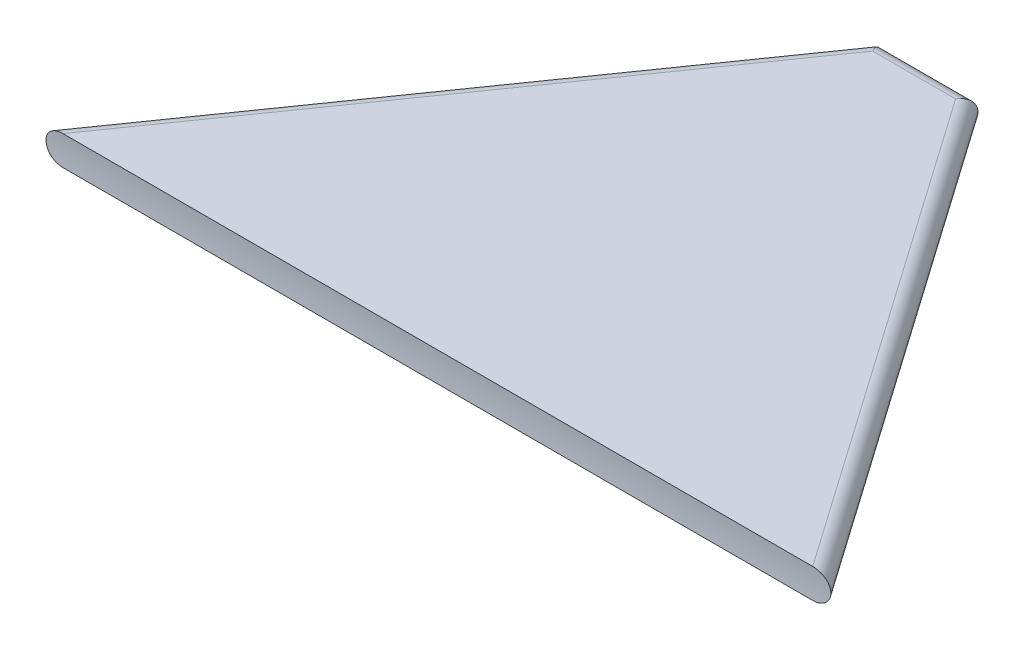
ISO-10303-21;
HEADER;
FILE_DESCRIPTION(('STEP AP214'),'2;1');
FILE_NAME('part.step','',(''),(''),'','','');
FILE_SCHEMA(('AUTOMOTIVE_DESIGN { 1 0 10303 214 1 1 1 1 }'));
ENDSEC;
DATA;
#1=APPLICATION_CONTEXT('core data for automotive mechanical design processes');
#2=APPLICATION_PROTOCOL_DEFINITION('international standard','automotive_design',2000,#1);
#3=PRODUCT_CONTEXT('',#1,'mechanical');
#4=PRODUCT('Part','Part','',(#3));
#5=PRODUCT_RELATED_PRODUCT_CATEGORY('part','',(#4));
#6=PRODUCT_DEFINITION_FORMATION('','',#4);
#7=PRODUCT_DEFINITION_CONTEXT('part definition',#1,'design');
#8=PRODUCT_DEFINITION('design','',#6,#7);
#9=PRODUCT_DEFINITION_SHAPE('','',#8);
#10=(LENGTH_UNIT() NAMED_UNIT(*) SI_UNIT(.MILLI.,.METRE.));
#11=(NAMED_UNIT(*) PLANE_ANGLE_UNIT() SI_UNIT($,.RADIAN.));
#12=(NAMED_UNIT(*) SI_UNIT($,.STERADIAN.) SOLID_ANGLE_UNIT());
#13=UNCERTAINTY_MEASURE_WITH_UNIT(LENGTH_MEASURE(1.E-05),#10,'distance_accuracy_value','');
#14=(GEOMETRIC_REPRESENTATION_CONTEXT(3) GLOBAL_UNCERTAINTY_ASSIGNED_CONTEXT((#13)) GLOBAL_UNIT_ASSIGNED_CONTEXT((#10,
#11,#12)) REPRESENTATION_CONTEXT('',''));
#15=CARTESIAN_POINT('',(0.,0.,0.));
#16=DIRECTION('',(0.,0.,1.));
#17=DIRECTION('',(1.,0.,0.));
#18=AXIS2_PLACEMENT_3D('',#15,#16,#17);
#19=CARTESIAN_POINT('',(0.,3.,0.));
#20=DIRECTION('',(0.,1.,0.));
#21=DIRECTION('',(0.,0.,1.));
#22=AXIS2_PLACEMENT_3D('',#19,#20,#21);
#23=PLANE('',#22);
#24=DIRECTION('',(1.,0.,0.));
#25=VECTOR('',#24,1.);
#26=CARTESIAN_POINT('',(-46.1054977438485,3.,0.));
#27=LINE('',#26,#25);
#28=CARTESIAN_POINT('',(-44.2745144014884,3.,0.));
#29=VERTEX_POINT('',#28);
#30=CARTESIAN_POINT('',(32.0635189137915,3.,0.));
#31=VERTEX_POINT('',#30);
#32=EDGE_CURVE('E106',#29,#31,#27,.T.);
#33=ORIENTED_EDGE('',*,*,#32,.T.);
#34=DIRECTION('',(-0.573462344363328,0.,-0.819231920519041));
#35=VECTOR('',#34,1.);
#36=CARTESIAN_POINT('',(-2.33434562462702,3.,-49.139806483455));
#37=LINE('',#36,#35);
#38=CARTESIAN_POINT('',(-1.8864810862085,3.,-48.5));
#39=VERTEX_POINT('',#38);
#40=EDGE_CURVE('E51',#31,#39,#37,.T.);
#41=ORIENTED_EDGE('',*,*,#40,.T.);
#42=DIRECTION('',(-1.,0.,0.));
#43=VECTOR('',#42,1.);
#44=CARTESIAN_POINT('',(-11.1054977438485,3.,-48.5));
#45=LINE('',#44,#43);
#46=CARTESIAN_POINT('',(-10.3245144014884,3.,-48.5));
#47=VERTEX_POINT('',#46);
#48=EDGE_CURVE('E59',#39,#47,#45,.T.);
#49=ORIENTED_EDGE('',*,*,#48,.T.);
#50=DIRECTION('',(-0.573462344363328,0.,0.819231920519041));
#51=VECTOR('',#50,1.);
#52=CARTESIAN_POINT('',(-44.8766498630699,3.,0.860193516544996));
#53=LINE('',#52,#51);
#54=EDGE_CURVE('E140',#47,#29,#53,.T.);
#55=ORIENTED_EDGE('',*,*,#54,.T.);
#56=EDGE_LOOP('',(#33,#41,#49,#55));
#57=FACE_BOUND('',#56,.T.);
#58=ADVANCED_FACE('F36',(#57),#23,.T.);
#59=CARTESIAN_POINT('',(0.,0.,0.));
#60=DIRECTION('',(0.,1.,0.));
#61=DIRECTION('',(0.,0.,1.));
#62=AXIS2_PLACEMENT_3D('',#59,#60,#61);
#63=PLANE('',#62);
#64=DIRECTION('',(-1.,0.,0.));
#65=VECTOR('',#64,1.);
#66=CARTESIAN_POINT('',(0.,0.,-48.5));
#67=LINE('',#66,#65);
#68=CARTESIAN_POINT('',(-10.3245144014884,0.,-48.5));
#69=VERTEX_POINT('',#68);
#70=CARTESIAN_POINT('',(-1.88648108620851,0.,-48.5));
#71=VERTEX_POINT('',#70);
#72=EDGE_CURVE('E95',#69,#71,#67,.F.);
#73=ORIENTED_EDGE('',*,*,#72,.T.);
#74=DIRECTION('',(-0.573462344363328,0.,-0.819231920519041));
#75=VECTOR('',#74,1.);
#76=CARTESIAN_POINT('',(21.5191402105983,0.,-15.0633981474188));
#77=LINE('',#76,#75);
#78=CARTESIAN_POINT('',(32.0635189137915,0.,0.));
#79=VERTEX_POINT('',#78);
#80=EDGE_CURVE('E99',#71,#79,#77,.F.);
#81=ORIENTED_EDGE('',*,*,#80,.T.);
#82=DIRECTION('',(1.,0.,0.));
#83=VECTOR('',#82,1.);
#84=CARTESIAN_POINT('',(-46.1054977438485,0.,0.));
#85=LINE('',#84,#83);
#86=CARTESIAN_POINT('',(-44.2745144014884,0.,0.));
#87=VERTEX_POINT('',#86);
#88=EDGE_CURVE('E133',#87,#79,#85,.T.);
#89=ORIENTED_EDGE('',*,*,#88,.F.);
#90=DIRECTION('',(-0.573462344363328,0.,0.819231920519041));
#91=VECTOR('',#90,1.);
#92=CARTESIAN_POINT('',(-29.7144391956298,0.,-20.8001074369409));
#93=LINE('',#92,#91);
#94=EDGE_CURVE('E101',#87,#69,#93,.F.);
#95=ORIENTED_EDGE('',*,*,#94,.T.);
#96=EDGE_LOOP('',(#73,#81,#89,#95));
#97=FACE_BOUND('',#96,.T.);
#98=ADVANCED_FACE('F97',(#97),#63,.F.);
#99=CARTESIAN_POINT('',(-29.7144391956298,1.5,-20.8001074369409));
#100=DIRECTION('',(0.573462344363328,0.,-0.819231920519041));
#101=DIRECTION('',(-0.819231920519041,0.,-0.573462344363328));
#102=AXIS2_PLACEMENT_3D('',#99,#100,#101);
#103=CYLINDRICAL_SURFACE('',#102,1.5);
#104=CARTESIAN_POINT('',(-44.2745144014884,3.,0.));
#105=CARTESIAN_POINT('',(-44.3382009659357,2.99998825338362,8.65655375250849E-07));
#106=CARTESIAN_POINT('',(-44.4018517896834,2.99727547465792,-0.000216086659095627));
#107=CARTESIAN_POINT('',(-44.5287392622743,2.98631693495949,-0.0010797299325599));
#108=CARTESIAN_POINT('',(-44.5919753902021,2.97806520790056,-0.0017268842614689));
#109=CARTESIAN_POINT('',(-44.7807241607876,2.94474552324019,-0.00430933200088901));
#110=CARTESIAN_POINT('',(-44.9048817217672,2.91111145630319,-0.00688554811933872));
#111=CARTESIAN_POINT('',(-45.1172950875952,2.83058413065742,-0.0126867071255565));
#112=CARTESIAN_POINT('',(-45.2073541838005,2.78836141190078,-0.0156362525641057));
#113=CARTESIAN_POINT('',(-45.3792401132866,2.68973540325946,-0.0220816512899539));
#114=CARTESIAN_POINT('',(-45.4610814015907,2.63335764607212,-0.0255765166842343));
#115=CARTESIAN_POINT('',(-45.6140234960528,2.50623599987034,-0.0327468065245787));
#116=CARTESIAN_POINT('',(-45.6850272705272,2.43537426595902,-0.0364235114656585));
#117=CARTESIAN_POINT('',(-45.8116518325417,2.2808727853339,-0.0434062243533402));
#118=CARTESIAN_POINT('',(-45.8672779568969,2.19723748737029,-0.0467123606683911));
#119=CARTESIAN_POINT('',(-45.9526558841045,2.03290944553521,-0.0519793934569253));
#120=CARTESIAN_POINT('',(-45.9849955548997,1.95356084907419,-0.0540660611672907));
#121=CARTESIAN_POINT('',(-46.0337470587451,1.7901972621449,-0.0572607631711594));
#122=CARTESIAN_POINT('',(-46.0502054007215,1.70619666388725,-0.0583716541921447));
#123=CARTESIAN_POINT('',(-46.0601533937113,1.60134450066582,-0.0590437961483084));
#124=CARTESIAN_POINT('',(-46.0615906901822,1.5810879078115,-0.0591409722281058));
#125=CARTESIAN_POINT('',(-46.0635050940414,1.54055733780779,-0.0592704728693632));
#126=CARTESIAN_POINT('',(-46.063983531689,1.52028342383502,-0.0593028872768238));
#127=CARTESIAN_POINT('',(-46.0639855912615,1.5,-0.0593030751241867));
#128=B_SPLINE_CURVE_WITH_KNOTS('',3,(#104,#105,#106,#107,#108,#109,#110,#111,#112,#113,#114,
#115,#116,#117,#118,#119,#120,#121,#122,#123,#124,#125,#126,#127),.UNSPECIFIED.,.F.,.F.,(4,2,2,
2,2,2,2,2,2,2,2,4),(0.,0.190924227704898,0.382054433520733,0.765485215312116,1.06285355222447,
1.35968930540345,1.6590438692783,1.95829441132203,2.21398010553392,2.46891472368585,
2.52982488664365,2.5906504880859),.UNSPECIFIED.);
#129=CARTESIAN_POINT('',(-46.0639855912615,1.5,-0.0593030751241917));
#130=VERTEX_POINT('',#129);
#131=EDGE_CURVE('E81',#29,#130,#128,.T.);
#132=ORIENTED_EDGE('',*,*,#131,.F.);
#133=ORIENTED_EDGE('',*,*,#54,.F.);
#134=CARTESIAN_POINT('',(-10.3245144014884,1.5,-48.5));
#135=DIRECTION('',(0.886978676283519,0.,-0.461810380804));
#136=DIRECTION('',(0.461810380804,0.,0.886978676283519));
#137=AXIS2_PLACEMENT_3D('',#134,#135,#136);
#138=ELLIPSE('',#137,1.69113422916216,1.5);
#139=CARTESIAN_POINT('',(-11.1054977438485,1.5,-50.));
#140=VERTEX_POINT('',#139);
#141=EDGE_CURVE('E131',#140,#47,#138,.T.);
#142=ORIENTED_EDGE('',*,*,#141,.F.);
#143=DIRECTION('',(-0.573462344363328,0.,0.819231920519041));
#144=VECTOR('',#143,1.);
#145=CARTESIAN_POINT('',(-11.1054977438484,1.5,-50.));
#146=LINE('',#145,#144);
#147=EDGE_CURVE('E130',#130,#140,#146,.F.);
#148=ORIENTED_EDGE('',*,*,#147,.F.);
#149=EDGE_LOOP('',(#132,#133,#142,#148));
#150=FACE_BOUND('',#149,.T.);
#151=ADVANCED_FACE('F38',(#150),#103,.T.);
#152=CARTESIAN_POINT('',(0.,1.5,-48.5));
#153=DIRECTION('',(1.,0.,0.));
#154=DIRECTION('',(0.,0.,-1.));
#155=AXIS2_PLACEMENT_3D('',#152,#153,#154);
#156=CYLINDRICAL_SURFACE('',#155,1.5);
#157=ORIENTED_EDGE('',*,*,#141,.T.);
#158=ORIENTED_EDGE('',*,*,#48,.F.);
#159=CARTESIAN_POINT('',(-1.88648108620851,1.5,-48.5));
#160=DIRECTION('',(0.886978676283519,0.,0.461810380804));
#161=DIRECTION('',(0.461810380804,0.,-0.886978676283519));
#162=AXIS2_PLACEMENT_3D('',#159,#160,#161);
#163=ELLIPSE('',#162,1.69113422916216,1.5);
#164=CARTESIAN_POINT('',(-1.10549774384845,1.5,-50.));
#165=VERTEX_POINT('',#164);
#166=EDGE_CURVE('E70',#165,#39,#163,.T.);
#167=ORIENTED_EDGE('',*,*,#166,.F.);
#168=DIRECTION('',(-1.,0.,0.));
#169=VECTOR('',#168,1.);
#170=CARTESIAN_POINT('',(-1.10549774384845,1.5,-50.));
#171=LINE('',#170,#169);
#172=EDGE_CURVE('E116',#140,#165,#171,.F.);
#173=ORIENTED_EDGE('',*,*,#172,.F.);
#174=EDGE_LOOP('',(#157,#158,#167,#173));
#175=FACE_BOUND('',#174,.T.);
#176=ADVANCED_FACE('F145',(#175),#156,.T.);
#177=CARTESIAN_POINT('',(-9.87664986306989,1.5,-49.139806483455));
#178=DIRECTION('',(-0.573462344363328,0.,0.819231920519041));
#179=DIRECTION('',(0.819231920519041,0.,0.573462344363328));
#180=AXIS2_PLACEMENT_3D('',#177,#178,#179);
#181=CYLINDRICAL_SURFACE('',#180,1.5);
#182=CARTESIAN_POINT('',(-46.0639855912615,1.5,-0.0593030751241917));
#183=CARTESIAN_POINT('',(-46.0639879953298,1.46228620755016,-0.059303784795781));
#184=CARTESIAN_POINT('',(-46.0623267576608,1.42459211727577,-0.0591906471654183));
#185=CARTESIAN_POINT('',(-46.0557177146137,1.34950633377035,-0.0587440299534168));
#186=CARTESIAN_POINT('',(-46.0507709569667,1.3121145479827,-0.0584106206151726));
#187=CARTESIAN_POINT('',(-46.0311290498095,1.20113053753896,-0.0570953962826096));
#188=CARTESIAN_POINT('',(-46.0116312990991,1.12833881214,-0.0557984314805437));
#189=CARTESIAN_POINT('',(-45.9607750568852,0.987182386452793,-0.0525128666221282));
#190=CARTESIAN_POINT('',(-45.9294260578199,0.918814194260485,-0.0505248202004345));
#191=CARTESIAN_POINT('',(-45.8562217784273,0.787931142704664,-0.0460682757769419));
#192=CARTESIAN_POINT('',(-45.8143577528452,0.725421215326651,-0.0435993782412805));
#193=CARTESIAN_POINT('',(-45.7194219335762,0.604509102331807,-0.0382900425053087));
#194=CARTESIAN_POINT('',(-45.6658966000408,0.546465361931217,-0.0354372385351372));
#195=CARTESIAN_POINT('',(-45.5509203512381,0.438916692775621,-0.0297275769841082));
#196=CARTESIAN_POINT('',(-45.4894687311598,0.389412524281435,-0.02687071906514));
#197=CARTESIAN_POINT('',(-45.3516655610329,0.293215239307214,-0.0210094286252724));
#198=CARTESIAN_POINT('',(-45.2744220981459,0.247800186324312,-0.0180369993848131));
#199=CARTESIAN_POINT('',(-45.1141278538293,0.168471180652314,-0.0126298478571136));
#200=CARTESIAN_POINT('',(-45.0310672939031,0.134577182974339,-0.0101960610414502));
#201=CARTESIAN_POINT('',(-44.8379474230306,0.0705116180244102,-0.00548875587833649));
#202=CARTESIAN_POINT('',(-44.7267074064321,0.0438817942124404,-0.00344034061722796));
#203=CARTESIAN_POINT('',(-44.5017370277022,0.00865156397465489,-0.000683390592443864));
#204=CARTESIAN_POINT('',(-44.3880159564987,-7.28084604039057E-06,2.94863634492936E-05));
#205=CARTESIAN_POINT('',(-44.2745144014884,0.,0.));
#206=B_SPLINE_CURVE_WITH_KNOTS('',3,(#182,#183,#184,#185,#186,#187,#188,#189,#190,#191,#192,
#193,#194,#195,#196,#197,#198,#199,#200,#201,#202,#203,#204,#205),.UNSPECIFIED.,.F.,.F.,(4,2,2,
2,2,2,2,2,2,2,2,4),(0.,0.113066273445151,0.226096508091479,0.451000512584329,0.675724757144774,
0.900636525362247,1.13672390893469,1.37283230005415,1.64076213181866,1.90915369379741,
2.25080932043475,2.59135219243471),.UNSPECIFIED.);
#207=EDGE_CURVE('E122',#130,#87,#206,.T.);
#208=ORIENTED_EDGE('',*,*,#207,.F.);
#209=ORIENTED_EDGE('',*,*,#147,.T.);
#210=CARTESIAN_POINT('',(-10.3245144014884,1.5,-48.5));
#211=DIRECTION('',(-0.886978676283519,0.,0.461810380804));
#212=DIRECTION('',(-0.461810380804,0.,-0.886978676283519));
#213=AXIS2_PLACEMENT_3D('',#210,#211,#212);
#214=ELLIPSE('',#213,1.69113422916216,1.5);
#215=EDGE_CURVE('E120',#69,#140,#214,.F.);
#216=ORIENTED_EDGE('',*,*,#215,.F.);
#217=ORIENTED_EDGE('',*,*,#94,.F.);
#218=EDGE_LOOP('',(#208,#209,#216,#217));
#219=FACE_BOUND('',#218,.T.);
#220=ADVANCED_FACE('F156',(#219),#181,.T.);
#221=CARTESIAN_POINT('',(21.5191402105983,1.5,-15.0633981474188));
#222=DIRECTION('',(0.573462344363328,0.,0.819231920519041));
#223=DIRECTION('',(0.81923192051904,0.,-0.573462344363328));
#224=AXIS2_PLACEMENT_3D('',#221,#222,#223);
#225=CYLINDRICAL_SURFACE('',#224,1.5);
#226=CARTESIAN_POINT('',(33.8529901035646,1.5,-0.0593030751241987));
#227=CARTESIAN_POINT('',(33.8529925076329,1.53771379244984,-0.0593037847957816));
#228=CARTESIAN_POINT('',(33.8513312699639,1.57540788272423,-0.0591906471654167));
#229=CARTESIAN_POINT('',(33.8447222269168,1.65049366622965,-0.0587440299534143));
#230=CARTESIAN_POINT('',(33.8397754692698,1.6878854520173,-0.0584106206151715));
#231=CARTESIAN_POINT('',(33.8201335621126,1.79886946246104,-0.0570953962826107));
#232=CARTESIAN_POINT('',(33.8006358114022,1.87166118785999,-0.0557984314805443));
#233=CARTESIAN_POINT('',(33.7497795691883,2.01281761354721,-0.0525128666221272));
#234=CARTESIAN_POINT('',(33.718430570123,2.08118580573952,-0.0505248202004325));
#235=CARTESIAN_POINT('',(33.6452262907304,2.21206885729534,-0.0460682757769383));
#236=CARTESIAN_POINT('',(33.6033622651483,2.27457878467335,-0.0435993782412765));
#237=CARTESIAN_POINT('',(33.5084264458793,2.3954908976682,-0.0382900425053047));
#238=CARTESIAN_POINT('',(33.4549011123439,2.45353463806879,-0.0354372385351336));
#239=CARTESIAN_POINT('',(33.3399248635412,2.56108330722438,-0.0297275769841034));
#240=CARTESIAN_POINT('',(33.2784732434628,2.61058747571857,-0.0268707190651335));
#241=CARTESIAN_POINT('',(33.140670073336,2.70678476069279,-0.0210094286252709));
#242=CARTESIAN_POINT('',(33.063426610449,2.75219981367569,-0.0180369993848193));
#243=CARTESIAN_POINT('',(32.9031323661324,2.83152881934768,-0.0126298478571201));
#244=CARTESIAN_POINT('',(32.8200718062062,2.86542281702566,-0.0101960610414494));
#245=CARTESIAN_POINT('',(32.6269519353337,2.92948838197559,-0.00548875587832813));
#246=CARTESIAN_POINT('',(32.5157119187352,2.95611820578756,-0.00344034061722223));
#247=CARTESIAN_POINT('',(32.2907415400052,2.99134843602535,-0.000683390592444676));
#248=CARTESIAN_POINT('',(32.1770204688018,3.00000728084604,2.94863634446109E-05));
#249=CARTESIAN_POINT('',(32.0635189137915,3.,0.));
#250=B_SPLINE_CURVE_WITH_KNOTS('',3,(#226,#227,#228,#229,#230,#231,#232,#233,#234,#235,#236,
#237,#238,#239,#240,#241,#242,#243,#244,#245,#246,#247,#248,#249),.UNSPECIFIED.,.F.,.F.,(4,2,2,
2,2,2,2,2,2,2,2,4),(0.,0.113066273445152,0.226096508091479,0.451000512584329,0.675724757144782,
0.900636525362245,1.13672390893469,1.37283230005416,1.64076213181867,1.90915369379741,
2.25080932043476,2.59135219243472),.UNSPECIFIED.);
#251=CARTESIAN_POINT('',(33.8529901035646,1.5,-0.0593030751241917));
#252=VERTEX_POINT('',#251);
#253=EDGE_CURVE('E149',#252,#31,#250,.T.);
#254=ORIENTED_EDGE('',*,*,#253,.F.);
#255=DIRECTION('',(-0.573462344363328,0.,-0.819231920519041));
#256=VECTOR('',#255,1.);
#257=CARTESIAN_POINT('',(33.8945022561516,1.5,0.));
#258=LINE('',#257,#256);
#259=EDGE_CURVE('E118',#165,#252,#258,.F.);
#260=ORIENTED_EDGE('',*,*,#259,.F.);
#261=ORIENTED_EDGE('',*,*,#166,.T.);
#262=ORIENTED_EDGE('',*,*,#40,.F.);
#263=EDGE_LOOP('',(#254,#260,#261,#262));
#264=FACE_BOUND('',#263,.T.);
#265=ADVANCED_FACE('F146',(#264),#225,.T.);
#266=CARTESIAN_POINT('',(-11.1054977438485,1.5,-48.5));
#267=DIRECTION('',(-1.,0.,0.));
#268=DIRECTION('',(0.,0.,1.));
#269=AXIS2_PLACEMENT_3D('',#266,#267,#268);
#270=CYLINDRICAL_SURFACE('',#269,1.5);
#271=ORIENTED_EDGE('',*,*,#215,.T.);
#272=ORIENTED_EDGE('',*,*,#172,.T.);
#273=CARTESIAN_POINT('',(-1.88648108620851,1.5,-48.5));
#274=DIRECTION('',(-0.886978676283519,0.,-0.461810380804));
#275=DIRECTION('',(-0.461810380804,0.,0.886978676283519));
#276=AXIS2_PLACEMENT_3D('',#273,#274,#275);
#277=ELLIPSE('',#276,1.69113422916216,1.5);
#278=EDGE_CURVE('E113',#71,#165,#277,.F.);
#279=ORIENTED_EDGE('',*,*,#278,.F.);
#280=ORIENTED_EDGE('',*,*,#72,.F.);
#281=EDGE_LOOP('',(#271,#272,#279,#280));
#282=FACE_BOUND('',#281,.T.);
#283=ADVANCED_FACE('F115',(#282),#270,.T.);
#284=CARTESIAN_POINT('',(-2.33434562462701,1.5,-49.139806483455));
#285=DIRECTION('',(-0.573462344363328,0.,-0.819231920519041));
#286=DIRECTION('',(-0.81923192051904,0.,0.573462344363328));
#287=AXIS2_PLACEMENT_3D('',#284,#285,#286);
#288=CYLINDRICAL_SURFACE('',#287,1.5);
#289=CARTESIAN_POINT('',(32.0635189137915,0.,0.));
#290=CARTESIAN_POINT('',(32.1272054782389,1.1746616377993E-05,8.65655379135096E-07));
#291=CARTESIAN_POINT('',(32.1908563019865,0.00272452534207939,-0.000216086659096348));
#292=CARTESIAN_POINT('',(32.3177437745774,0.013683065040513,-0.00107972993256449));
#293=CARTESIAN_POINT('',(32.3809799025052,0.0219347920994455,-0.00172688426147274));
#294=CARTESIAN_POINT('',(32.5697286730907,0.0552544767598114,-0.00430933200089077));
#295=CARTESIAN_POINT('',(32.6938862340703,0.0888885436968161,-0.00688554811933929));
#296=CARTESIAN_POINT('',(32.9062995998983,0.169415869342585,-0.0126867071255567));
#297=CARTESIAN_POINT('',(32.9963586961036,0.211638588099222,-0.0156362525641063));
#298=CARTESIAN_POINT('',(33.1682446255897,0.310264596740541,-0.0220816512899548));
#299=CARTESIAN_POINT('',(33.2500859138938,0.366642353927884,-0.0255765166842351));
#300=CARTESIAN_POINT('',(33.4030280083559,0.493764000129668,-0.0327468065245786));
#301=CARTESIAN_POINT('',(33.4740317828303,0.564625734040989,-0.0364235114656577));
#302=CARTESIAN_POINT('',(33.6006563448448,0.719127214666111,-0.0434062243533403));
#303=CARTESIAN_POINT('',(33.6562824692,0.802762512629716,-0.0467123606683927));
#304=CARTESIAN_POINT('',(33.7416603964076,0.9670905544648,-0.0519793934569239));
#305=CARTESIAN_POINT('',(33.7740000672028,1.04643915092582,-0.0540660611672853));
#306=CARTESIAN_POINT('',(33.8227515710482,1.20980273785511,-0.0572607631711611));
#307=CARTESIAN_POINT('',(33.8392099130246,1.29380333611275,-0.0583716541921571));
#308=CARTESIAN_POINT('',(33.8491579060144,1.39865549933418,-0.0590437961483089));
#309=CARTESIAN_POINT('',(33.8505952024853,1.4189120921885,-0.0591409722281029));
#310=CARTESIAN_POINT('',(33.8525096063445,1.45944266219221,-0.059270472869358));
#311=CARTESIAN_POINT('',(33.852988043992,1.47971657616498,-0.0593028872768197));
#312=CARTESIAN_POINT('',(33.8529901035646,1.5,-0.0593030751241894));
#313=B_SPLINE_CURVE_WITH_KNOTS('',3,(#289,#290,#291,#292,#293,#294,#295,#296,#297,#298,#299,
#300,#301,#302,#303,#304,#305,#306,#307,#308,#309,#310,#311,#312),.UNSPECIFIED.,.F.,.F.,(4,2,2,
2,2,2,2,2,2,2,2,4),(0.,0.190924227704898,0.382054433520733,0.765485215312117,1.06285355222447,
1.35968930540345,1.6590438692783,1.95829441132204,2.21398010553392,2.46891472368584,
2.52982488664365,2.59065048808589),.UNSPECIFIED.);
#314=EDGE_CURVE('E11',#79,#252,#313,.T.);
#315=ORIENTED_EDGE('',*,*,#314,.F.);
#316=ORIENTED_EDGE('',*,*,#80,.F.);
#317=ORIENTED_EDGE('',*,*,#278,.T.);
#318=ORIENTED_EDGE('',*,*,#259,.T.);
#319=EDGE_LOOP('',(#315,#316,#317,#318));
#320=FACE_BOUND('',#319,.T.);
#321=ADVANCED_FACE('F111',(#320),#288,.T.);
#322=CARTESIAN_POINT('',(-46.1054977438485,1.5,18.9406969248758));
#323=DIRECTION('',(1.,0.,0.));
#324=DIRECTION('',(0.,0.,-1.));
#325=AXIS2_PLACEMENT_3D('',#322,#323,#324);
#326=CYLINDRICAL_SURFACE('',#325,19.);
#327=ORIENTED_EDGE('',*,*,#131,.T.);
#328=ORIENTED_EDGE('',*,*,#207,.T.);
#329=ORIENTED_EDGE('',*,*,#88,.T.);
#330=ORIENTED_EDGE('',*,*,#314,.T.);
#331=ORIENTED_EDGE('',*,*,#253,.T.);
#332=ORIENTED_EDGE('',*,*,#32,.F.);
#333=EDGE_LOOP('',(#327,#328,#329,#330,#331,#332));
#334=FACE_BOUND('',#333,.T.);
#335=ADVANCED_FACE('F152',(#334),#326,.F.);
#336=CLOSED_SHELL('',(#58,#98,#151,#176,#220,#265,#283,#321,#335));
#337=MANIFOLD_SOLID_BREP('B2',#336);
#338=ADVANCED_BREP_SHAPE_REPRESENTATION('',(#18,#337),#14);
#339=SHAPE_DEFINITION_REPRESENTATION(#9,#338);
ENDSEC;
END-ISO-10303-21;
